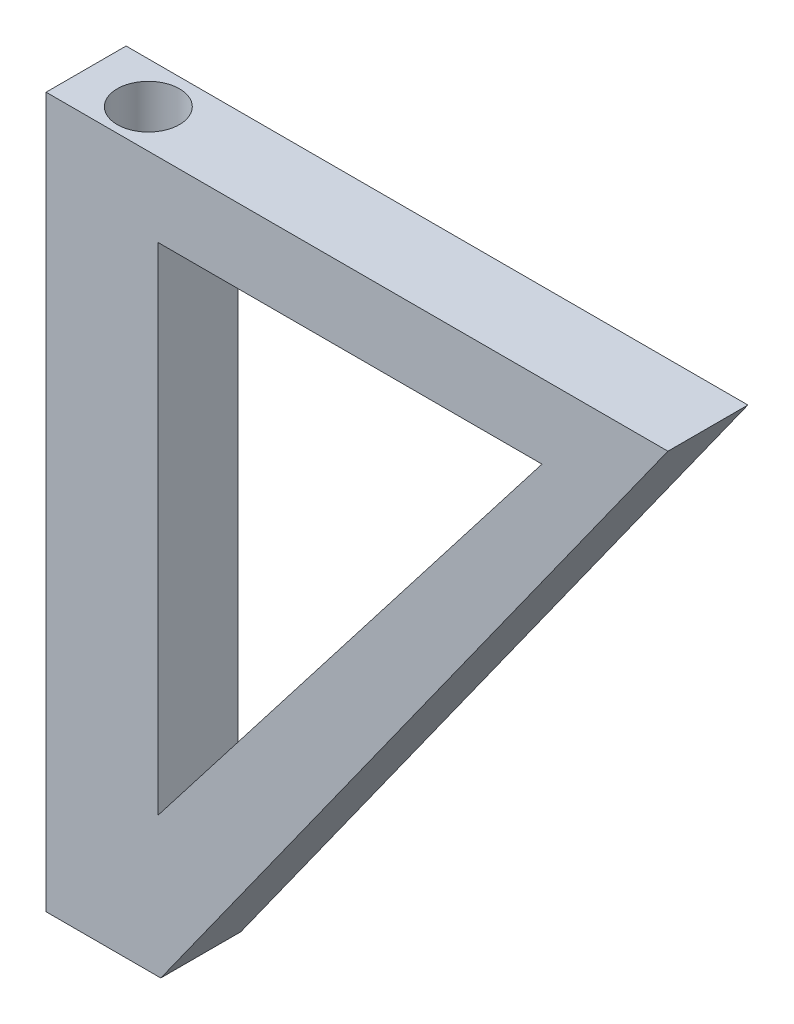
ISO-10303-21;
HEADER;
FILE_DESCRIPTION(('STEP AP214'),'2;1');
FILE_NAME('part.step','',(''),(''),'','','');
FILE_SCHEMA(('AUTOMOTIVE_DESIGN { 1 0 10303 214 1 1 1 1 }'));
ENDSEC;
DATA;
#1=APPLICATION_CONTEXT('core data for automotive mechanical design processes');
#2=APPLICATION_PROTOCOL_DEFINITION('international standard','automotive_design',2000,#1);
#3=PRODUCT_CONTEXT('',#1,'mechanical');
#4=PRODUCT('Part','Part','',(#3));
#5=PRODUCT_RELATED_PRODUCT_CATEGORY('part','',(#4));
#6=PRODUCT_DEFINITION_FORMATION('','',#4);
#7=PRODUCT_DEFINITION_CONTEXT('part definition',#1,'design');
#8=PRODUCT_DEFINITION('design','',#6,#7);
#9=PRODUCT_DEFINITION_SHAPE('','',#8);
#10=(LENGTH_UNIT() NAMED_UNIT(*) SI_UNIT(.MILLI.,.METRE.));
#11=(NAMED_UNIT(*) PLANE_ANGLE_UNIT() SI_UNIT($,.RADIAN.));
#12=(NAMED_UNIT(*) SI_UNIT($,.STERADIAN.) SOLID_ANGLE_UNIT());
#13=UNCERTAINTY_MEASURE_WITH_UNIT(LENGTH_MEASURE(1.E-05),#10,'distance_accuracy_value','');
#14=(GEOMETRIC_REPRESENTATION_CONTEXT(3) GLOBAL_UNCERTAINTY_ASSIGNED_CONTEXT((#13)) GLOBAL_UNIT_ASSIGNED_CONTEXT((#10,
#11,#12)) REPRESENTATION_CONTEXT('',''));
#15=CARTESIAN_POINT('',(0.,0.,0.));
#16=DIRECTION('',(0.,0.,1.));
#17=DIRECTION('',(1.,0.,0.));
#18=AXIS2_PLACEMENT_3D('',#15,#16,#17);
#19=CARTESIAN_POINT('',(0.,-88.7375417130145,10.));
#20=DIRECTION('',(1.,0.,0.));
#21=DIRECTION('',(0.,0.,-1.));
#22=AXIS2_PLACEMENT_3D('',#19,#20,#21);
#23=PLANE('',#22);
#24=DIRECTION('',(0.,-1.,0.));
#25=VECTOR('',#24,1.);
#26=CARTESIAN_POINT('',(0.,-88.7375417130145,0.));
#27=LINE('',#26,#25);
#28=CARTESIAN_POINT('',(0.,0.,0.));
#29=VERTEX_POINT('',#28);
#30=CARTESIAN_POINT('',(0.,-88.7375417130145,0.));
#31=VERTEX_POINT('',#30);
#32=EDGE_CURVE('E122',#29,#31,#27,.T.);
#33=ORIENTED_EDGE('',*,*,#32,.T.);
#34=DIRECTION('',(0.,0.,-1.));
#35=VECTOR('',#34,1.);
#36=CARTESIAN_POINT('',(0.,-88.7375417130145,10.));
#37=LINE('',#36,#35);
#38=CARTESIAN_POINT('',(0.,-88.7375417130145,10.));
#39=VERTEX_POINT('',#38);
#40=EDGE_CURVE('E11',#39,#31,#37,.T.);
#41=ORIENTED_EDGE('',*,*,#40,.F.);
#42=DIRECTION('',(0.,-1.,0.));
#43=VECTOR('',#42,1.);
#44=CARTESIAN_POINT('',(0.,-88.7375417130145,10.));
#45=LINE('',#44,#43);
#46=CARTESIAN_POINT('',(0.,0.,10.));
#47=VERTEX_POINT('',#46);
#48=EDGE_CURVE('E125',#47,#39,#45,.T.);
#49=ORIENTED_EDGE('',*,*,#48,.F.);
#50=DIRECTION('',(0.,0.,-1.));
#51=VECTOR('',#50,1.);
#52=CARTESIAN_POINT('',(0.,0.,10.));
#53=LINE('',#52,#51);
#54=EDGE_CURVE('E135',#47,#29,#53,.T.);
#55=ORIENTED_EDGE('',*,*,#54,.T.);
#56=EDGE_LOOP('',(#33,#41,#49,#55));
#57=FACE_BOUND('',#56,.T.);
#58=ADVANCED_FACE('F33',(#57),#23,.F.);
#59=CARTESIAN_POINT('',(14.3371144678791,-88.7375417130145,10.));
#60=DIRECTION('',(0.,1.,0.));
#61=DIRECTION('',(0.,0.,1.));
#62=AXIS2_PLACEMENT_3D('',#59,#60,#61);
#63=PLANE('',#62);
#64=CARTESIAN_POINT('',(7.9599362115772,-88.7375417130145,5.17936915478323));
#65=DIRECTION('',(0.,1.,0.));
#66=DIRECTION('',(0.,0.,1.));
#67=AXIS2_PLACEMENT_3D('',#64,#65,#66);
#68=CIRCLE('',#67,3.88915114287515);
#69=CARTESIAN_POINT('',(7.9599362115772,-88.7375417130145,9.06852029765838));
#70=VERTEX_POINT('',#69);
#71=EDGE_CURVE('E119',#70,#70,#68,.T.);
#72=ORIENTED_EDGE('',*,*,#71,.T.);
#73=EDGE_LOOP('',(#72));
#74=FACE_BOUND('',#73,.T.);
#75=DIRECTION('',(1.,0.,0.));
#76=VECTOR('',#75,1.);
#77=CARTESIAN_POINT('',(14.3371144678791,-88.7375417130145,0.));
#78=LINE('',#77,#76);
#79=CARTESIAN_POINT('',(14.3371144678791,-88.7375417130145,0.));
#80=VERTEX_POINT('',#79);
#81=EDGE_CURVE('E138',#31,#80,#78,.T.);
#82=ORIENTED_EDGE('',*,*,#81,.T.);
#83=DIRECTION('',(0.,0.,-1.));
#84=VECTOR('',#83,1.);
#85=CARTESIAN_POINT('',(14.3371144678791,-88.7375417130145,10.));
#86=LINE('',#85,#84);
#87=CARTESIAN_POINT('',(14.3371144678791,-88.7375417130145,10.));
#88=VERTEX_POINT('',#87);
#89=EDGE_CURVE('E40',#88,#80,#86,.T.);
#90=ORIENTED_EDGE('',*,*,#89,.F.);
#91=DIRECTION('',(1.,0.,0.));
#92=VECTOR('',#91,1.);
#93=CARTESIAN_POINT('',(14.3371144678791,-88.7375417130145,10.));
#94=LINE('',#93,#92);
#95=EDGE_CURVE('E128',#39,#88,#94,.T.);
#96=ORIENTED_EDGE('',*,*,#95,.F.);
#97=ORIENTED_EDGE('',*,*,#40,.T.);
#98=EDGE_LOOP('',(#82,#90,#96,#97));
#99=FACE_BOUND('',#98,.T.);
#100=ADVANCED_FACE('F166',(#74,#99),#63,.F.);
#101=CARTESIAN_POINT('',(77.7382268149313,0.,10.));
#102=DIRECTION('',(-0.813659070814496,0.581342340175986,0.));
#103=DIRECTION('',(-0.581342340175986,-0.813659070814496,0.));
#104=AXIS2_PLACEMENT_3D('',#101,#102,#103);
#105=PLANE('',#104);
#106=DIRECTION('',(0.581342340175986,0.813659070814496,0.));
#107=VECTOR('',#106,1.);
#108=CARTESIAN_POINT('',(77.7382268149313,0.,0.));
#109=LINE('',#108,#107);
#110=CARTESIAN_POINT('',(77.7382268149313,0.,0.));
#111=VERTEX_POINT('',#110);
#112=EDGE_CURVE('E140',#80,#111,#109,.T.);
#113=ORIENTED_EDGE('',*,*,#112,.T.);
#114=DIRECTION('',(0.,0.,-1.));
#115=VECTOR('',#114,1.);
#116=CARTESIAN_POINT('',(77.7382268149313,0.,10.));
#117=LINE('',#116,#115);
#118=CARTESIAN_POINT('',(77.7382268149313,0.,10.));
#119=VERTEX_POINT('',#118);
#120=EDGE_CURVE('E145',#119,#111,#117,.T.);
#121=ORIENTED_EDGE('',*,*,#120,.F.);
#122=DIRECTION('',(0.581342340175986,0.813659070814496,0.));
#123=VECTOR('',#122,1.);
#124=CARTESIAN_POINT('',(77.7382268149313,0.,10.));
#125=LINE('',#124,#123);
#126=EDGE_CURVE('E131',#88,#119,#125,.T.);
#127=ORIENTED_EDGE('',*,*,#126,.F.);
#128=ORIENTED_EDGE('',*,*,#89,.T.);
#129=EDGE_LOOP('',(#113,#121,#127,#128));
#130=FACE_BOUND('',#129,.T.);
#131=ADVANCED_FACE('F152',(#130),#105,.F.);
#132=CARTESIAN_POINT('',(0.,0.,10.));
#133=DIRECTION('',(0.,-1.,0.));
#134=DIRECTION('',(0.,0.,-1.));
#135=AXIS2_PLACEMENT_3D('',#132,#133,#134);
#136=PLANE('',#135);
#137=CARTESIAN_POINT('',(7.9599362115772,0.,5.17936915478323));
#138=DIRECTION('',(0.,1.,0.));
#139=DIRECTION('',(0.,0.,1.));
#140=AXIS2_PLACEMENT_3D('',#137,#138,#139);
#141=CIRCLE('',#140,3.88915114287515);
#142=CARTESIAN_POINT('',(7.9599362115772,0.,9.06852029765838));
#143=VERTEX_POINT('',#142);
#144=EDGE_CURVE('E117',#143,#143,#141,.T.);
#145=ORIENTED_EDGE('',*,*,#144,.F.);
#146=EDGE_LOOP('',(#145));
#147=FACE_BOUND('',#146,.T.);
#148=DIRECTION('',(-1.,0.,0.));
#149=VECTOR('',#148,1.);
#150=CARTESIAN_POINT('',(0.,0.,0.));
#151=LINE('',#150,#149);
#152=EDGE_CURVE('E129',#111,#29,#151,.T.);
#153=ORIENTED_EDGE('',*,*,#152,.T.);
#154=ORIENTED_EDGE('',*,*,#54,.F.);
#155=DIRECTION('',(-1.,0.,0.));
#156=VECTOR('',#155,1.);
#157=CARTESIAN_POINT('',(0.,0.,10.));
#158=LINE('',#157,#156);
#159=EDGE_CURVE('E133',#119,#47,#158,.T.);
#160=ORIENTED_EDGE('',*,*,#159,.F.);
#161=ORIENTED_EDGE('',*,*,#120,.T.);
#162=EDGE_LOOP('',(#153,#154,#160,#161));
#163=FACE_BOUND('',#162,.T.);
#164=ADVANCED_FACE('F159',(#147,#163),#136,.F.);
#165=CARTESIAN_POINT('',(0.,0.,10.));
#166=DIRECTION('',(0.,0.,-1.));
#167=DIRECTION('',(-1.,0.,0.));
#168=AXIS2_PLACEMENT_3D('',#165,#166,#167);
#169=PLANE('',#168);
#170=DIRECTION('',(0.,-1.,0.));
#171=VECTOR('',#170,1.);
#172=CARTESIAN_POINT('',(13.9925549621149,-9.27296891834797,10.));
#173=LINE('',#172,#171);
#174=CARTESIAN_POINT('',(13.9925549621149,-9.27296891834797,10.));
#175=VERTEX_POINT('',#174);
#176=CARTESIAN_POINT('',(13.9925549621149,-71.2891780004197,10.));
#177=VERTEX_POINT('',#176);
#178=EDGE_CURVE('E109',#175,#177,#173,.T.);
#179=ORIENTED_EDGE('',*,*,#178,.F.);
#180=DIRECTION('',(-1.,0.,0.));
#181=VECTOR('',#180,1.);
#182=CARTESIAN_POINT('',(61.9938015397636,-9.27296891834797,10.));
#183=LINE('',#182,#181);
#184=CARTESIAN_POINT('',(61.9938015397636,-9.27296891834797,10.));
#185=VERTEX_POINT('',#184);
#186=EDGE_CURVE('E47',#185,#175,#183,.T.);
#187=ORIENTED_EDGE('',*,*,#186,.F.);
#188=DIRECTION('',(0.612083078053053,0.790793465805769,0.));
#189=VECTOR('',#188,1.);
#190=CARTESIAN_POINT('',(13.9925549621149,-71.2891780004197,10.));
#191=LINE('',#190,#189);
#192=EDGE_CURVE('E106',#177,#185,#191,.T.);
#193=ORIENTED_EDGE('',*,*,#192,.F.);
#194=EDGE_LOOP('',(#179,#187,#193));
#195=FACE_BOUND('',#194,.T.);
#196=ORIENTED_EDGE('',*,*,#48,.T.);
#197=ORIENTED_EDGE('',*,*,#95,.T.);
#198=ORIENTED_EDGE('',*,*,#126,.T.);
#199=ORIENTED_EDGE('',*,*,#159,.T.);
#200=EDGE_LOOP('',(#196,#197,#198,#199));
#201=FACE_BOUND('',#200,.T.);
#202=ADVANCED_FACE('F165',(#195,#201),#169,.F.);
#203=CARTESIAN_POINT('',(0.,0.,0.));
#204=DIRECTION('',(0.,0.,-1.));
#205=DIRECTION('',(-1.,0.,0.));
#206=AXIS2_PLACEMENT_3D('',#203,#204,#205);
#207=PLANE('',#206);
#208=DIRECTION('',(-1.,0.,0.));
#209=VECTOR('',#208,1.);
#210=CARTESIAN_POINT('',(61.9938015397636,-9.27296891834797,0.));
#211=LINE('',#210,#209);
#212=CARTESIAN_POINT('',(61.9938015397636,-9.27296891834797,0.));
#213=VERTEX_POINT('',#212);
#214=CARTESIAN_POINT('',(13.9925549621149,-9.27296891834797,0.));
#215=VERTEX_POINT('',#214);
#216=EDGE_CURVE('E93',#213,#215,#211,.T.);
#217=ORIENTED_EDGE('',*,*,#216,.T.);
#218=DIRECTION('',(0.,-1.,0.));
#219=VECTOR('',#218,1.);
#220=CARTESIAN_POINT('',(13.9925549621149,-9.27296891834797,0.));
#221=LINE('',#220,#219);
#222=CARTESIAN_POINT('',(13.9925549621149,-71.2891780004197,0.));
#223=VERTEX_POINT('',#222);
#224=EDGE_CURVE('E100',#215,#223,#221,.T.);
#225=ORIENTED_EDGE('',*,*,#224,.T.);
#226=DIRECTION('',(0.612083078053053,0.790793465805769,0.));
#227=VECTOR('',#226,1.);
#228=CARTESIAN_POINT('',(13.9925549621149,-71.2891780004197,0.));
#229=LINE('',#228,#227);
#230=EDGE_CURVE('E55',#223,#213,#229,.T.);
#231=ORIENTED_EDGE('',*,*,#230,.T.);
#232=EDGE_LOOP('',(#217,#225,#231));
#233=FACE_BOUND('',#232,.T.);
#234=ORIENTED_EDGE('',*,*,#32,.F.);
#235=ORIENTED_EDGE('',*,*,#152,.F.);
#236=ORIENTED_EDGE('',*,*,#112,.F.);
#237=ORIENTED_EDGE('',*,*,#81,.F.);
#238=EDGE_LOOP('',(#234,#235,#236,#237));
#239=FACE_BOUND('',#238,.T.);
#240=ADVANCED_FACE('F104',(#233,#239),#207,.T.);
#241=CARTESIAN_POINT('',(7.9599362115772,-88.7375417130145,5.17936915478323));
#242=DIRECTION('',(0.,1.,0.));
#243=DIRECTION('',(0.,0.,1.));
#244=AXIS2_PLACEMENT_3D('',#241,#242,#243);
#245=CYLINDRICAL_SURFACE('',#244,3.88915114287515);
#246=ORIENTED_EDGE('',*,*,#71,.F.);
#247=EDGE_LOOP('',(#246));
#248=FACE_BOUND('',#247,.T.);
#249=ORIENTED_EDGE('',*,*,#144,.T.);
#250=EDGE_LOOP('',(#249));
#251=FACE_BOUND('',#250,.T.);
#252=ADVANCED_FACE('F180',(#248,#251),#245,.F.);
#253=CARTESIAN_POINT('',(61.9938015397636,-9.27296891834797,0.));
#254=DIRECTION('',(0.,1.,0.));
#255=DIRECTION('',(0.,0.,1.));
#256=AXIS2_PLACEMENT_3D('',#253,#254,#255);
#257=PLANE('',#256);
#258=ORIENTED_EDGE('',*,*,#186,.T.);
#259=DIRECTION('',(0.,0.,1.));
#260=VECTOR('',#259,1.);
#261=CARTESIAN_POINT('',(13.9925549621149,-9.27296891834797,0.));
#262=LINE('',#261,#260);
#263=EDGE_CURVE('E89',#215,#175,#262,.T.);
#264=ORIENTED_EDGE('',*,*,#263,.F.);
#265=ORIENTED_EDGE('',*,*,#216,.F.);
#266=DIRECTION('',(0.,0.,1.));
#267=VECTOR('',#266,1.);
#268=CARTESIAN_POINT('',(61.9938015397636,-9.27296891834797,0.));
#269=LINE('',#268,#267);
#270=EDGE_CURVE('E115',#213,#185,#269,.T.);
#271=ORIENTED_EDGE('',*,*,#270,.T.);
#272=EDGE_LOOP('',(#258,#264,#265,#271));
#273=FACE_BOUND('',#272,.T.);
#274=ADVANCED_FACE('F91',(#273),#257,.F.);
#275=CARTESIAN_POINT('',(13.9925549621149,-71.2891780004197,0.));
#276=DIRECTION('',(0.790793465805769,-0.612083078053053,0.));
#277=DIRECTION('',(0.612083078053053,0.790793465805769,0.));
#278=AXIS2_PLACEMENT_3D('',#275,#276,#277);
#279=PLANE('',#278);
#280=ORIENTED_EDGE('',*,*,#192,.T.);
#281=ORIENTED_EDGE('',*,*,#270,.F.);
#282=ORIENTED_EDGE('',*,*,#230,.F.);
#283=DIRECTION('',(0.,0.,1.));
#284=VECTOR('',#283,1.);
#285=CARTESIAN_POINT('',(13.9925549621149,-71.2891780004197,0.));
#286=LINE('',#285,#284);
#287=EDGE_CURVE('E97',#223,#177,#286,.T.);
#288=ORIENTED_EDGE('',*,*,#287,.T.);
#289=EDGE_LOOP('',(#280,#281,#282,#288));
#290=FACE_BOUND('',#289,.T.);
#291=ADVANCED_FACE('F189',(#290),#279,.F.);
#292=CARTESIAN_POINT('',(13.9925549621149,-9.27296891834797,0.));
#293=DIRECTION('',(-1.,0.,0.));
#294=DIRECTION('',(0.,0.,1.));
#295=AXIS2_PLACEMENT_3D('',#292,#293,#294);
#296=PLANE('',#295);
#297=ORIENTED_EDGE('',*,*,#178,.T.);
#298=ORIENTED_EDGE('',*,*,#287,.F.);
#299=ORIENTED_EDGE('',*,*,#224,.F.);
#300=ORIENTED_EDGE('',*,*,#263,.T.);
#301=EDGE_LOOP('',(#297,#298,#299,#300));
#302=FACE_BOUND('',#301,.T.);
#303=ADVANCED_FACE('F101',(#302),#296,.F.);
#304=CLOSED_SHELL('',(#58,#100,#131,#164,#202,#240,#252,#274,#291,#303));
#305=MANIFOLD_SOLID_BREP('B2',#304);
#306=ADVANCED_BREP_SHAPE_REPRESENTATION('',(#18,#305),#14);
#307=SHAPE_DEFINITION_REPRESENTATION(#9,#306);
ENDSEC;
END-ISO-10303-21;
